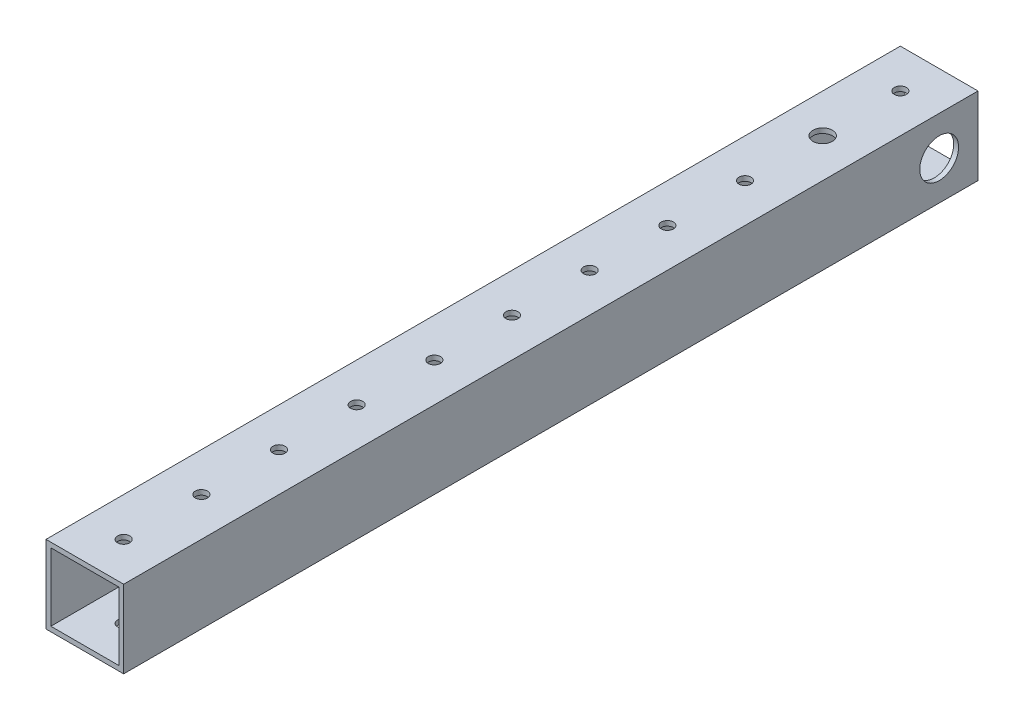
ISO-10303-21;
HEADER;
FILE_DESCRIPTION(('STEP AP214'),'2;1');
FILE_NAME('part.step','',(''),(''),'','','');
FILE_SCHEMA(('AUTOMOTIVE_DESIGN { 1 0 10303 214 1 1 1 1 }'));
ENDSEC;
DATA;
#1=APPLICATION_CONTEXT('core data for automotive mechanical design processes');
#2=APPLICATION_PROTOCOL_DEFINITION('international standard','automotive_design',2000,#1);
#3=PRODUCT_CONTEXT('',#1,'mechanical');
#4=PRODUCT('Part','Part','',(#3));
#5=PRODUCT_RELATED_PRODUCT_CATEGORY('part','',(#4));
#6=PRODUCT_DEFINITION_FORMATION('','',#4);
#7=PRODUCT_DEFINITION_CONTEXT('part definition',#1,'design');
#8=PRODUCT_DEFINITION('design','',#6,#7);
#9=PRODUCT_DEFINITION_SHAPE('','',#8);
#10=(LENGTH_UNIT() NAMED_UNIT(*) SI_UNIT(.MILLI.,.METRE.));
#11=(NAMED_UNIT(*) PLANE_ANGLE_UNIT() SI_UNIT($,.RADIAN.));
#12=(NAMED_UNIT(*) SI_UNIT($,.STERADIAN.) SOLID_ANGLE_UNIT());
#13=UNCERTAINTY_MEASURE_WITH_UNIT(LENGTH_MEASURE(1.E-05),#10,'distance_accuracy_value','');
#14=(GEOMETRIC_REPRESENTATION_CONTEXT(3) GLOBAL_UNCERTAINTY_ASSIGNED_CONTEXT((#13)) GLOBAL_UNIT_ASSIGNED_CONTEXT((#10,
#11,#12)) REPRESENTATION_CONTEXT('',''));
#15=CARTESIAN_POINT('',(0.,0.,0.));
#16=DIRECTION('',(0.,0.,1.));
#17=DIRECTION('',(1.,0.,0.));
#18=AXIS2_PLACEMENT_3D('',#15,#16,#17);
#19=CARTESIAN_POINT('',(0.,0.,279.4));
#20=DIRECTION('',(0.,0.,1.));
#21=DIRECTION('',(1.,0.,0.));
#22=AXIS2_PLACEMENT_3D('',#19,#20,#21);
#23=PLANE('',#22);
#24=DIRECTION('',(0.,1.,0.));
#25=VECTOR('',#24,1.);
#26=CARTESIAN_POINT('',(12.7,12.7,279.4));
#27=LINE('',#26,#25);
#28=CARTESIAN_POINT('',(12.7,-12.7,279.4));
#29=VERTEX_POINT('',#28);
#30=CARTESIAN_POINT('',(12.7,12.7,279.4));
#31=VERTEX_POINT('',#30);
#32=EDGE_CURVE('E138',#29,#31,#27,.T.);
#33=ORIENTED_EDGE('',*,*,#32,.T.);
#34=DIRECTION('',(-1.,0.,0.));
#35=VECTOR('',#34,1.);
#36=CARTESIAN_POINT('',(-12.7,12.7,279.4));
#37=LINE('',#36,#35);
#38=CARTESIAN_POINT('',(-12.7,12.7,279.4));
#39=VERTEX_POINT('',#38);
#40=EDGE_CURVE('E141',#31,#39,#37,.T.);
#41=ORIENTED_EDGE('',*,*,#40,.T.);
#42=DIRECTION('',(0.,-1.,0.));
#43=VECTOR('',#42,1.);
#44=CARTESIAN_POINT('',(-12.7,12.7,279.4));
#45=LINE('',#44,#43);
#46=CARTESIAN_POINT('',(-12.7,-12.7,279.4));
#47=VERTEX_POINT('',#46);
#48=EDGE_CURVE('E144',#39,#47,#45,.T.);
#49=ORIENTED_EDGE('',*,*,#48,.T.);
#50=DIRECTION('',(1.,0.,0.));
#51=VECTOR('',#50,1.);
#52=CARTESIAN_POINT('',(-12.7,-12.7,279.4));
#53=LINE('',#52,#51);
#54=EDGE_CURVE('E146',#47,#29,#53,.T.);
#55=ORIENTED_EDGE('',*,*,#54,.T.);
#56=EDGE_LOOP('',(#33,#41,#49,#55));
#57=FACE_BOUND('',#56,.T.);
#58=DIRECTION('',(-1.,0.,0.));
#59=VECTOR('',#58,1.);
#60=CARTESIAN_POINT('',(-11.1125,11.1125,279.4));
#61=LINE('',#60,#59);
#62=CARTESIAN_POINT('',(11.1125,11.1125,279.4));
#63=VERTEX_POINT('',#62);
#64=CARTESIAN_POINT('',(-11.1125,11.1125,279.4));
#65=VERTEX_POINT('',#64);
#66=EDGE_CURVE('E108',#63,#65,#61,.T.);
#67=ORIENTED_EDGE('',*,*,#66,.F.);
#68=DIRECTION('',(0.,1.,0.));
#69=VECTOR('',#68,1.);
#70=CARTESIAN_POINT('',(11.1125,11.1125,279.4));
#71=LINE('',#70,#69);
#72=CARTESIAN_POINT('',(11.1125,-11.1125,279.4));
#73=VERTEX_POINT('',#72);
#74=EDGE_CURVE('E100',#73,#63,#71,.T.);
#75=ORIENTED_EDGE('',*,*,#74,.F.);
#76=DIRECTION('',(1.,0.,0.));
#77=VECTOR('',#76,1.);
#78=CARTESIAN_POINT('',(-11.1125,-11.1125,279.4));
#79=LINE('',#78,#77);
#80=CARTESIAN_POINT('',(-11.1125,-11.1125,279.4));
#81=VERTEX_POINT('',#80);
#82=EDGE_CURVE('E122',#81,#73,#79,.T.);
#83=ORIENTED_EDGE('',*,*,#82,.F.);
#84=DIRECTION('',(0.,-1.,0.));
#85=VECTOR('',#84,1.);
#86=CARTESIAN_POINT('',(-11.1125,11.1125,279.4));
#87=LINE('',#86,#85);
#88=EDGE_CURVE('E120',#65,#81,#87,.T.);
#89=ORIENTED_EDGE('',*,*,#88,.F.);
#90=EDGE_LOOP('',(#67,#75,#83,#89));
#91=FACE_BOUND('',#90,.T.);
#92=ADVANCED_FACE('F33',(#57,#91),#23,.T.);
#93=CARTESIAN_POINT('',(0.,0.,0.));
#94=DIRECTION('',(0.,0.,1.));
#95=DIRECTION('',(1.,0.,0.));
#96=AXIS2_PLACEMENT_3D('',#93,#94,#95);
#97=PLANE('',#96);
#98=DIRECTION('',(0.,1.,0.));
#99=VECTOR('',#98,1.);
#100=CARTESIAN_POINT('',(12.7,12.7,0.));
#101=LINE('',#100,#99);
#102=CARTESIAN_POINT('',(12.7,-12.7,0.));
#103=VERTEX_POINT('',#102);
#104=CARTESIAN_POINT('',(12.7,12.7,0.));
#105=VERTEX_POINT('',#104);
#106=EDGE_CURVE('E116',#103,#105,#101,.T.);
#107=ORIENTED_EDGE('',*,*,#106,.F.);
#108=DIRECTION('',(1.,0.,0.));
#109=VECTOR('',#108,1.);
#110=CARTESIAN_POINT('',(-12.7,-12.7,0.));
#111=LINE('',#110,#109);
#112=CARTESIAN_POINT('',(-12.7,-12.7,0.));
#113=VERTEX_POINT('',#112);
#114=EDGE_CURVE('E142',#113,#103,#111,.T.);
#115=ORIENTED_EDGE('',*,*,#114,.F.);
#116=DIRECTION('',(0.,-1.,0.));
#117=VECTOR('',#116,1.);
#118=CARTESIAN_POINT('',(-12.7,12.7,0.));
#119=LINE('',#118,#117);
#120=CARTESIAN_POINT('',(-12.7,12.7,0.));
#121=VERTEX_POINT('',#120);
#122=EDGE_CURVE('E153',#121,#113,#119,.T.);
#123=ORIENTED_EDGE('',*,*,#122,.F.);
#124=DIRECTION('',(-1.,0.,0.));
#125=VECTOR('',#124,1.);
#126=CARTESIAN_POINT('',(-12.7,12.7,0.));
#127=LINE('',#126,#125);
#128=EDGE_CURVE('E151',#105,#121,#127,.T.);
#129=ORIENTED_EDGE('',*,*,#128,.F.);
#130=EDGE_LOOP('',(#107,#115,#123,#129));
#131=FACE_BOUND('',#130,.T.);
#132=DIRECTION('',(0.,1.,0.));
#133=VECTOR('',#132,1.);
#134=CARTESIAN_POINT('',(11.1125,11.1125,0.));
#135=LINE('',#134,#133);
#136=CARTESIAN_POINT('',(11.1125,-11.1125,0.));
#137=VERTEX_POINT('',#136);
#138=CARTESIAN_POINT('',(11.1125,11.1125,0.));
#139=VERTEX_POINT('',#138);
#140=EDGE_CURVE('E58',#137,#139,#135,.T.);
#141=ORIENTED_EDGE('',*,*,#140,.T.);
#142=DIRECTION('',(-1.,0.,0.));
#143=VECTOR('',#142,1.);
#144=CARTESIAN_POINT('',(-11.1125,11.1125,0.));
#145=LINE('',#144,#143);
#146=CARTESIAN_POINT('',(-11.1125,11.1125,0.));
#147=VERTEX_POINT('',#146);
#148=EDGE_CURVE('E115',#139,#147,#145,.T.);
#149=ORIENTED_EDGE('',*,*,#148,.T.);
#150=DIRECTION('',(0.,-1.,0.));
#151=VECTOR('',#150,1.);
#152=CARTESIAN_POINT('',(-11.1125,11.1125,0.));
#153=LINE('',#152,#151);
#154=CARTESIAN_POINT('',(-11.1125,-11.1125,0.));
#155=VERTEX_POINT('',#154);
#156=EDGE_CURVE('E130',#147,#155,#153,.T.);
#157=ORIENTED_EDGE('',*,*,#156,.T.);
#158=DIRECTION('',(1.,0.,0.));
#159=VECTOR('',#158,1.);
#160=CARTESIAN_POINT('',(-11.1125,-11.1125,0.));
#161=LINE('',#160,#159);
#162=EDGE_CURVE('E109',#155,#137,#161,.T.);
#163=ORIENTED_EDGE('',*,*,#162,.T.);
#164=EDGE_LOOP('',(#141,#149,#157,#163));
#165=FACE_BOUND('',#164,.T.);
#166=ADVANCED_FACE('F320',(#131,#165),#97,.F.);
#167=CARTESIAN_POINT('',(12.7,12.7,279.4));
#168=DIRECTION('',(-1.,0.,0.));
#169=DIRECTION('',(0.,-1.,0.));
#170=AXIS2_PLACEMENT_3D('',#167,#168,#169);
#171=PLANE('',#170);
#172=CARTESIAN_POINT('',(12.7,0.,12.7));
#173=DIRECTION('',(1.,0.,0.));
#174=DIRECTION('',(0.,1.,0.));
#175=AXIS2_PLACEMENT_3D('',#172,#173,#174);
#176=CIRCLE('',#175,6.35);
#177=CARTESIAN_POINT('',(12.7,6.35,12.7));
#178=VERTEX_POINT('',#177);
#179=EDGE_CURVE('E454',#178,#178,#176,.T.);
#180=ORIENTED_EDGE('',*,*,#179,.F.);
#181=EDGE_LOOP('',(#180));
#182=FACE_BOUND('',#181,.T.);
#183=ORIENTED_EDGE('',*,*,#106,.T.);
#184=DIRECTION('',(0.,0.,-1.));
#185=VECTOR('',#184,1.);
#186=CARTESIAN_POINT('',(12.7,12.7,279.4));
#187=LINE('',#186,#185);
#188=EDGE_CURVE('E11',#31,#105,#187,.T.);
#189=ORIENTED_EDGE('',*,*,#188,.F.);
#190=ORIENTED_EDGE('',*,*,#32,.F.);
#191=DIRECTION('',(0.,0.,-1.));
#192=VECTOR('',#191,1.);
#193=CARTESIAN_POINT('',(12.7,-12.7,279.4));
#194=LINE('',#193,#192);
#195=EDGE_CURVE('E148',#29,#103,#194,.T.);
#196=ORIENTED_EDGE('',*,*,#195,.T.);
#197=EDGE_LOOP('',(#183,#189,#190,#196));
#198=FACE_BOUND('',#197,.T.);
#199=ADVANCED_FACE('F35',(#182,#198),#171,.F.);
#200=CARTESIAN_POINT('',(-12.7,12.7,279.4));
#201=DIRECTION('',(0.,-1.,0.));
#202=DIRECTION('',(0.,0.,-1.));
#203=AXIS2_PLACEMENT_3D('',#200,#201,#202);
#204=PLANE('',#203);
#205=CARTESIAN_POINT('',(-7.9815263405954E-13,12.7,38.1000000000002));
#206=DIRECTION('',(0.,1.,0.));
#207=DIRECTION('',(0.,0.,1.));
#208=AXIS2_PLACEMENT_3D('',#205,#206,#207);
#209=CIRCLE('',#208,3.175);
#210=CARTESIAN_POINT('',(-7.9815263405954E-13,12.7,41.2750000000002));
#211=VERTEX_POINT('',#210);
#212=EDGE_CURVE('E221',#211,#211,#209,.T.);
#213=ORIENTED_EDGE('',*,*,#212,.F.);
#214=EDGE_LOOP('',(#213));
#215=FACE_BOUND('',#214,.T.);
#216=CARTESIAN_POINT('',(-8.86836260066155E-13,12.7,12.7000000000002));
#217=DIRECTION('',(0.,1.,0.));
#218=DIRECTION('',(0.,0.,1.));
#219=AXIS2_PLACEMENT_3D('',#216,#217,#218);
#220=CIRCLE('',#219,1.98437499999999);
#221=CARTESIAN_POINT('',(-8.86836260066155E-13,12.7,14.6843750000002));
#222=VERTEX_POINT('',#221);
#223=EDGE_CURVE('E218',#222,#222,#220,.T.);
#224=ORIENTED_EDGE('',*,*,#223,.F.);
#225=EDGE_LOOP('',(#224));
#226=FACE_BOUND('',#225,.T.);
#227=CARTESIAN_POINT('',(-7.09469008052924E-13,12.7,63.5000000000002));
#228=DIRECTION('',(0.,1.,0.));
#229=DIRECTION('',(0.,0.,1.));
#230=AXIS2_PLACEMENT_3D('',#227,#228,#229);
#231=CIRCLE('',#230,1.98437499999999);
#232=CARTESIAN_POINT('',(-7.09469008052924E-13,12.7,65.4843750000002));
#233=VERTEX_POINT('',#232);
#234=EDGE_CURVE('E237',#233,#233,#231,.T.);
#235=ORIENTED_EDGE('',*,*,#234,.F.);
#236=EDGE_LOOP('',(#235));
#237=FACE_BOUND('',#236,.T.);
#238=CARTESIAN_POINT('',(-6.20785382046309E-13,12.7,88.9000000000001));
#239=DIRECTION('',(0.,1.,0.));
#240=DIRECTION('',(0.,0.,1.));
#241=AXIS2_PLACEMENT_3D('',#238,#239,#240);
#242=CIRCLE('',#241,1.98437499999999);
#243=CARTESIAN_POINT('',(-6.20785382046309E-13,12.7,90.8843750000001));
#244=VERTEX_POINT('',#243);
#245=EDGE_CURVE('E244',#244,#244,#242,.T.);
#246=ORIENTED_EDGE('',*,*,#245,.F.);
#247=EDGE_LOOP('',(#246));
#248=FACE_BOUND('',#247,.T.);
#249=CARTESIAN_POINT('',(-5.32101756039693E-13,12.7,114.3));
#250=DIRECTION('',(0.,1.,0.));
#251=DIRECTION('',(0.,0.,1.));
#252=AXIS2_PLACEMENT_3D('',#249,#250,#251);
#253=CIRCLE('',#252,1.98437499999999);
#254=CARTESIAN_POINT('',(-5.32101756039693E-13,12.7,116.284375));
#255=VERTEX_POINT('',#254);
#256=EDGE_CURVE('E251',#255,#255,#253,.T.);
#257=ORIENTED_EDGE('',*,*,#256,.F.);
#258=EDGE_LOOP('',(#257));
#259=FACE_BOUND('',#258,.T.);
#260=CARTESIAN_POINT('',(-4.43418130033078E-13,12.7,139.7));
#261=DIRECTION('',(0.,1.,0.));
#262=DIRECTION('',(0.,0.,1.));
#263=AXIS2_PLACEMENT_3D('',#260,#261,#262);
#264=CIRCLE('',#263,1.984375);
#265=CARTESIAN_POINT('',(-4.43418130033078E-13,12.7,141.684375));
#266=VERTEX_POINT('',#265);
#267=EDGE_CURVE('E258',#266,#266,#264,.T.);
#268=ORIENTED_EDGE('',*,*,#267,.F.);
#269=EDGE_LOOP('',(#268));
#270=FACE_BOUND('',#269,.T.);
#271=CARTESIAN_POINT('',(-3.54734504026462E-13,12.7,165.1));
#272=DIRECTION('',(0.,1.,0.));
#273=DIRECTION('',(0.,0.,1.));
#274=AXIS2_PLACEMENT_3D('',#271,#272,#273);
#275=CIRCLE('',#274,1.984375);
#276=CARTESIAN_POINT('',(-3.54734504026462E-13,12.7,167.084375));
#277=VERTEX_POINT('',#276);
#278=EDGE_CURVE('E265',#277,#277,#275,.T.);
#279=ORIENTED_EDGE('',*,*,#278,.F.);
#280=EDGE_LOOP('',(#279));
#281=FACE_BOUND('',#280,.T.);
#282=CARTESIAN_POINT('',(-2.66050878019846E-13,12.7,190.5));
#283=DIRECTION('',(0.,1.,0.));
#284=DIRECTION('',(0.,0.,1.));
#285=AXIS2_PLACEMENT_3D('',#282,#283,#284);
#286=CIRCLE('',#285,1.984375);
#287=CARTESIAN_POINT('',(-2.66050878019846E-13,12.7,192.484375));
#288=VERTEX_POINT('',#287);
#289=EDGE_CURVE('E272',#288,#288,#286,.T.);
#290=ORIENTED_EDGE('',*,*,#289,.F.);
#291=EDGE_LOOP('',(#290));
#292=FACE_BOUND('',#291,.T.);
#293=CARTESIAN_POINT('',(-1.77367252013231E-13,12.7,215.9));
#294=DIRECTION('',(0.,1.,0.));
#295=DIRECTION('',(0.,0.,1.));
#296=AXIS2_PLACEMENT_3D('',#293,#294,#295);
#297=CIRCLE('',#296,1.984375);
#298=CARTESIAN_POINT('',(-1.77367252013231E-13,12.7,217.884375));
#299=VERTEX_POINT('',#298);
#300=EDGE_CURVE('E279',#299,#299,#297,.T.);
#301=ORIENTED_EDGE('',*,*,#300,.F.);
#302=EDGE_LOOP('',(#301));
#303=FACE_BOUND('',#302,.T.);
#304=CARTESIAN_POINT('',(0.,12.7,241.3));
#305=DIRECTION('',(0.,1.,0.));
#306=DIRECTION('',(0.,0.,1.));
#307=AXIS2_PLACEMENT_3D('',#304,#305,#306);
#308=CIRCLE('',#307,1.984375);
#309=CARTESIAN_POINT('',(0.,12.7,243.284375));
#310=VERTEX_POINT('',#309);
#311=EDGE_CURVE('E286',#310,#310,#308,.T.);
#312=ORIENTED_EDGE('',*,*,#311,.F.);
#313=EDGE_LOOP('',(#312));
#314=FACE_BOUND('',#313,.T.);
#315=CARTESIAN_POINT('',(0.,12.7,266.7));
#316=DIRECTION('',(0.,1.,0.));
#317=DIRECTION('',(0.,0.,1.));
#318=AXIS2_PLACEMENT_3D('',#315,#316,#317);
#319=CIRCLE('',#318,1.98437499999999);
#320=CARTESIAN_POINT('',(0.,12.7,268.684375));
#321=VERTEX_POINT('',#320);
#322=EDGE_CURVE('E293',#321,#321,#319,.T.);
#323=ORIENTED_EDGE('',*,*,#322,.F.);
#324=EDGE_LOOP('',(#323));
#325=FACE_BOUND('',#324,.T.);
#326=ORIENTED_EDGE('',*,*,#128,.T.);
#327=DIRECTION('',(0.,0.,-1.));
#328=VECTOR('',#327,1.);
#329=CARTESIAN_POINT('',(-12.7,12.7,279.4));
#330=LINE('',#329,#328);
#331=EDGE_CURVE('E42',#39,#121,#330,.T.);
#332=ORIENTED_EDGE('',*,*,#331,.F.);
#333=ORIENTED_EDGE('',*,*,#40,.F.);
#334=ORIENTED_EDGE('',*,*,#188,.T.);
#335=EDGE_LOOP('',(#326,#332,#333,#334));
#336=FACE_BOUND('',#335,.T.);
#337=ADVANCED_FACE('F333',(#215,#226,#237,#248,#259,#270,#281,#292,#303,#314,#325,#336),#204,.F.);
#338=CARTESIAN_POINT('',(-12.7,12.7,279.4));
#339=DIRECTION('',(1.,0.,0.));
#340=DIRECTION('',(0.,1.,0.));
#341=AXIS2_PLACEMENT_3D('',#338,#339,#340);
#342=PLANE('',#341);
#343=CARTESIAN_POINT('',(-12.7,0.,12.7));
#344=DIRECTION('',(1.,0.,0.));
#345=DIRECTION('',(0.,1.,0.));
#346=AXIS2_PLACEMENT_3D('',#343,#344,#345);
#347=CIRCLE('',#346,6.35);
#348=CARTESIAN_POINT('',(-12.7,6.35,12.7));
#349=VERTEX_POINT('',#348);
#350=EDGE_CURVE('E453',#349,#349,#347,.T.);
#351=ORIENTED_EDGE('',*,*,#350,.T.);
#352=EDGE_LOOP('',(#351));
#353=FACE_BOUND('',#352,.T.);
#354=ORIENTED_EDGE('',*,*,#122,.T.);
#355=DIRECTION('',(0.,0.,-1.));
#356=VECTOR('',#355,1.);
#357=CARTESIAN_POINT('',(-12.7,-12.7,279.4));
#358=LINE('',#357,#356);
#359=EDGE_CURVE('E158',#47,#113,#358,.T.);
#360=ORIENTED_EDGE('',*,*,#359,.F.);
#361=ORIENTED_EDGE('',*,*,#48,.F.);
#362=ORIENTED_EDGE('',*,*,#331,.T.);
#363=EDGE_LOOP('',(#354,#360,#361,#362));
#364=FACE_BOUND('',#363,.T.);
#365=ADVANCED_FACE('F331',(#353,#364),#342,.F.);
#366=CARTESIAN_POINT('',(-12.7,-12.7,279.4));
#367=DIRECTION('',(0.,1.,0.));
#368=DIRECTION('',(0.,0.,1.));
#369=AXIS2_PLACEMENT_3D('',#366,#367,#368);
#370=PLANE('',#369);
#371=CARTESIAN_POINT('',(-7.9815263405954E-13,-12.7,38.1000000000002));
#372=DIRECTION('',(0.,1.,0.));
#373=DIRECTION('',(0.,0.,1.));
#374=AXIS2_PLACEMENT_3D('',#371,#372,#373);
#375=CIRCLE('',#374,3.175);
#376=CARTESIAN_POINT('',(-7.9815263405954E-13,-12.7,41.2750000000002));
#377=VERTEX_POINT('',#376);
#378=EDGE_CURVE('E214',#377,#377,#375,.T.);
#379=ORIENTED_EDGE('',*,*,#378,.T.);
#380=EDGE_LOOP('',(#379));
#381=FACE_BOUND('',#380,.T.);
#382=CARTESIAN_POINT('',(-8.86836260066155E-13,-12.7,12.7000000000002));
#383=DIRECTION('',(0.,1.,0.));
#384=DIRECTION('',(0.,0.,1.));
#385=AXIS2_PLACEMENT_3D('',#382,#383,#384);
#386=CIRCLE('',#385,1.98437499999999);
#387=CARTESIAN_POINT('',(-8.86836260066155E-13,-12.7,14.6843750000002));
#388=VERTEX_POINT('',#387);
#389=EDGE_CURVE('E210',#388,#388,#386,.T.);
#390=ORIENTED_EDGE('',*,*,#389,.T.);
#391=EDGE_LOOP('',(#390));
#392=FACE_BOUND('',#391,.T.);
#393=CARTESIAN_POINT('',(-7.09469008052924E-13,-12.7,63.5000000000002));
#394=DIRECTION('',(0.,1.,0.));
#395=DIRECTION('',(0.,0.,1.));
#396=AXIS2_PLACEMENT_3D('',#393,#394,#395);
#397=CIRCLE('',#396,1.98437499999999);
#398=CARTESIAN_POINT('',(-7.09469008052924E-13,-12.7,65.4843750000002));
#399=VERTEX_POINT('',#398);
#400=EDGE_CURVE('E206',#399,#399,#397,.T.);
#401=ORIENTED_EDGE('',*,*,#400,.T.);
#402=EDGE_LOOP('',(#401));
#403=FACE_BOUND('',#402,.T.);
#404=CARTESIAN_POINT('',(-6.20785382046309E-13,-12.7,88.9000000000001));
#405=DIRECTION('',(0.,1.,0.));
#406=DIRECTION('',(0.,0.,1.));
#407=AXIS2_PLACEMENT_3D('',#404,#405,#406);
#408=CIRCLE('',#407,1.98437499999999);
#409=CARTESIAN_POINT('',(-6.20785382046309E-13,-12.7,90.8843750000001));
#410=VERTEX_POINT('',#409);
#411=EDGE_CURVE('E201',#410,#410,#408,.T.);
#412=ORIENTED_EDGE('',*,*,#411,.T.);
#413=EDGE_LOOP('',(#412));
#414=FACE_BOUND('',#413,.T.);
#415=CARTESIAN_POINT('',(-5.32101756039693E-13,-12.7,114.3));
#416=DIRECTION('',(0.,1.,0.));
#417=DIRECTION('',(0.,0.,1.));
#418=AXIS2_PLACEMENT_3D('',#415,#416,#417);
#419=CIRCLE('',#418,1.98437499999999);
#420=CARTESIAN_POINT('',(-5.32101756039693E-13,-12.7,116.284375));
#421=VERTEX_POINT('',#420);
#422=EDGE_CURVE('E196',#421,#421,#419,.T.);
#423=ORIENTED_EDGE('',*,*,#422,.T.);
#424=EDGE_LOOP('',(#423));
#425=FACE_BOUND('',#424,.T.);
#426=CARTESIAN_POINT('',(-4.43418130033078E-13,-12.7,139.7));
#427=DIRECTION('',(0.,1.,0.));
#428=DIRECTION('',(0.,0.,1.));
#429=AXIS2_PLACEMENT_3D('',#426,#427,#428);
#430=CIRCLE('',#429,1.984375);
#431=CARTESIAN_POINT('',(-4.43418130033078E-13,-12.7,141.684375));
#432=VERTEX_POINT('',#431);
#433=EDGE_CURVE('E191',#432,#432,#430,.T.);
#434=ORIENTED_EDGE('',*,*,#433,.T.);
#435=EDGE_LOOP('',(#434));
#436=FACE_BOUND('',#435,.T.);
#437=CARTESIAN_POINT('',(-3.54734504026462E-13,-12.7,165.1));
#438=DIRECTION('',(0.,1.,0.));
#439=DIRECTION('',(0.,0.,1.));
#440=AXIS2_PLACEMENT_3D('',#437,#438,#439);
#441=CIRCLE('',#440,1.984375);
#442=CARTESIAN_POINT('',(-3.54734504026462E-13,-12.7,167.084375));
#443=VERTEX_POINT('',#442);
#444=EDGE_CURVE('E186',#443,#443,#441,.T.);
#445=ORIENTED_EDGE('',*,*,#444,.T.);
#446=EDGE_LOOP('',(#445));
#447=FACE_BOUND('',#446,.T.);
#448=CARTESIAN_POINT('',(-2.66050878019846E-13,-12.7,190.5));
#449=DIRECTION('',(0.,1.,0.));
#450=DIRECTION('',(0.,0.,1.));
#451=AXIS2_PLACEMENT_3D('',#448,#449,#450);
#452=CIRCLE('',#451,1.984375);
#453=CARTESIAN_POINT('',(-2.66050878019846E-13,-12.7,192.484375));
#454=VERTEX_POINT('',#453);
#455=EDGE_CURVE('E181',#454,#454,#452,.T.);
#456=ORIENTED_EDGE('',*,*,#455,.T.);
#457=EDGE_LOOP('',(#456));
#458=FACE_BOUND('',#457,.T.);
#459=CARTESIAN_POINT('',(-1.77367252013231E-13,-12.7,215.9));
#460=DIRECTION('',(0.,1.,0.));
#461=DIRECTION('',(0.,0.,1.));
#462=AXIS2_PLACEMENT_3D('',#459,#460,#461);
#463=CIRCLE('',#462,1.984375);
#464=CARTESIAN_POINT('',(-1.77367252013231E-13,-12.7,217.884375));
#465=VERTEX_POINT('',#464);
#466=EDGE_CURVE('E176',#465,#465,#463,.T.);
#467=ORIENTED_EDGE('',*,*,#466,.T.);
#468=EDGE_LOOP('',(#467));
#469=FACE_BOUND('',#468,.T.);
#470=CARTESIAN_POINT('',(0.,-12.7,241.3));
#471=DIRECTION('',(0.,1.,0.));
#472=DIRECTION('',(0.,0.,1.));
#473=AXIS2_PLACEMENT_3D('',#470,#471,#472);
#474=CIRCLE('',#473,1.984375);
#475=CARTESIAN_POINT('',(0.,-12.7,243.284375));
#476=VERTEX_POINT('',#475);
#477=EDGE_CURVE('E171',#476,#476,#474,.T.);
#478=ORIENTED_EDGE('',*,*,#477,.T.);
#479=EDGE_LOOP('',(#478));
#480=FACE_BOUND('',#479,.T.);
#481=CARTESIAN_POINT('',(0.,-12.7,266.7));
#482=DIRECTION('',(0.,1.,0.));
#483=DIRECTION('',(0.,0.,1.));
#484=AXIS2_PLACEMENT_3D('',#481,#482,#483);
#485=CIRCLE('',#484,1.98437499999999);
#486=CARTESIAN_POINT('',(0.,-12.7,268.684375));
#487=VERTEX_POINT('',#486);
#488=EDGE_CURVE('E166',#487,#487,#485,.T.);
#489=ORIENTED_EDGE('',*,*,#488,.T.);
#490=EDGE_LOOP('',(#489));
#491=FACE_BOUND('',#490,.T.);
#492=ORIENTED_EDGE('',*,*,#114,.T.);
#493=ORIENTED_EDGE('',*,*,#195,.F.);
#494=ORIENTED_EDGE('',*,*,#54,.F.);
#495=ORIENTED_EDGE('',*,*,#359,.T.);
#496=EDGE_LOOP('',(#492,#493,#494,#495));
#497=FACE_BOUND('',#496,.T.);
#498=ADVANCED_FACE('F314',(#381,#392,#403,#414,#425,#436,#447,#458,#469,#480,#491,#497),#370,.F.);
#499=CARTESIAN_POINT('',(11.1125,11.1125,279.4));
#500=DIRECTION('',(-1.,0.,0.));
#501=DIRECTION('',(0.,0.,1.));
#502=AXIS2_PLACEMENT_3D('',#499,#500,#501);
#503=PLANE('',#502);
#504=CARTESIAN_POINT('',(11.1125,0.,12.7));
#505=DIRECTION('',(-1.,0.,0.));
#506=DIRECTION('',(0.,0.,1.));
#507=AXIS2_PLACEMENT_3D('',#504,#505,#506);
#508=CIRCLE('',#507,6.35);
#509=CARTESIAN_POINT('',(11.1125,0.,19.05));
#510=VERTEX_POINT('',#509);
#511=EDGE_CURVE('E226',#510,#510,#508,.T.);
#512=ORIENTED_EDGE('',*,*,#511,.F.);
#513=EDGE_LOOP('',(#512));
#514=FACE_BOUND('',#513,.T.);
#515=ORIENTED_EDGE('',*,*,#140,.F.);
#516=DIRECTION('',(0.,0.,-1.));
#517=VECTOR('',#516,1.);
#518=CARTESIAN_POINT('',(11.1125,-11.1125,279.4));
#519=LINE('',#518,#517);
#520=EDGE_CURVE('E104',#73,#137,#519,.T.);
#521=ORIENTED_EDGE('',*,*,#520,.F.);
#522=ORIENTED_EDGE('',*,*,#74,.T.);
#523=DIRECTION('',(0.,0.,-1.));
#524=VECTOR('',#523,1.);
#525=CARTESIAN_POINT('',(11.1125,11.1125,279.4));
#526=LINE('',#525,#524);
#527=EDGE_CURVE('E103',#63,#139,#526,.T.);
#528=ORIENTED_EDGE('',*,*,#527,.T.);
#529=EDGE_LOOP('',(#515,#521,#522,#528));
#530=FACE_BOUND('',#529,.T.);
#531=ADVANCED_FACE('F102',(#514,#530),#503,.T.);
#532=CARTESIAN_POINT('',(-11.1125,11.1125,279.4));
#533=DIRECTION('',(0.,-1.,0.));
#534=DIRECTION('',(0.,0.,-1.));
#535=AXIS2_PLACEMENT_3D('',#532,#533,#534);
#536=PLANE('',#535);
#537=CARTESIAN_POINT('',(-7.9815263405954E-13,11.1125,38.1000000000002));
#538=DIRECTION('',(0.,-1.,0.));
#539=DIRECTION('',(0.,0.,-1.));
#540=AXIS2_PLACEMENT_3D('',#537,#538,#539);
#541=CIRCLE('',#540,3.175);
#542=CARTESIAN_POINT('',(-7.9815263405954E-13,11.1125,34.9250000000002));
#543=VERTEX_POINT('',#542);
#544=EDGE_CURVE('E213',#543,#543,#541,.T.);
#545=ORIENTED_EDGE('',*,*,#544,.F.);
#546=EDGE_LOOP('',(#545));
#547=FACE_BOUND('',#546,.T.);
#548=CARTESIAN_POINT('',(-8.86836260066155E-13,11.1125,12.7000000000002));
#549=DIRECTION('',(0.,-1.,0.));
#550=DIRECTION('',(0.,0.,-1.));
#551=AXIS2_PLACEMENT_3D('',#548,#549,#550);
#552=CIRCLE('',#551,1.98437499999999);
#553=CARTESIAN_POINT('',(-8.86836260066155E-13,11.1125,10.7156250000002));
#554=VERTEX_POINT('',#553);
#555=EDGE_CURVE('E209',#554,#554,#552,.T.);
#556=ORIENTED_EDGE('',*,*,#555,.F.);
#557=EDGE_LOOP('',(#556));
#558=FACE_BOUND('',#557,.T.);
#559=CARTESIAN_POINT('',(-7.09469008052924E-13,11.1125,63.5000000000002));
#560=DIRECTION('',(0.,-1.,0.));
#561=DIRECTION('',(0.,0.,-1.));
#562=AXIS2_PLACEMENT_3D('',#559,#560,#561);
#563=CIRCLE('',#562,1.98437499999999);
#564=CARTESIAN_POINT('',(-7.09469008052924E-13,11.1125,61.5156250000002));
#565=VERTEX_POINT('',#564);
#566=EDGE_CURVE('E205',#565,#565,#563,.T.);
#567=ORIENTED_EDGE('',*,*,#566,.F.);
#568=EDGE_LOOP('',(#567));
#569=FACE_BOUND('',#568,.T.);
#570=CARTESIAN_POINT('',(-6.20785382046309E-13,11.1125,88.9000000000001));
#571=DIRECTION('',(0.,-1.,0.));
#572=DIRECTION('',(0.,0.,-1.));
#573=AXIS2_PLACEMENT_3D('',#570,#571,#572);
#574=CIRCLE('',#573,1.98437499999999);
#575=CARTESIAN_POINT('',(-6.20785382046309E-13,11.1125,86.9156250000001));
#576=VERTEX_POINT('',#575);
#577=EDGE_CURVE('E200',#576,#576,#574,.T.);
#578=ORIENTED_EDGE('',*,*,#577,.F.);
#579=EDGE_LOOP('',(#578));
#580=FACE_BOUND('',#579,.T.);
#581=CARTESIAN_POINT('',(-5.32101756039693E-13,11.1125,114.3));
#582=DIRECTION('',(0.,-1.,0.));
#583=DIRECTION('',(0.,0.,-1.));
#584=AXIS2_PLACEMENT_3D('',#581,#582,#583);
#585=CIRCLE('',#584,1.98437499999999);
#586=CARTESIAN_POINT('',(-5.32101756039693E-13,11.1125,112.315625));
#587=VERTEX_POINT('',#586);
#588=EDGE_CURVE('E195',#587,#587,#585,.T.);
#589=ORIENTED_EDGE('',*,*,#588,.F.);
#590=EDGE_LOOP('',(#589));
#591=FACE_BOUND('',#590,.T.);
#592=CARTESIAN_POINT('',(-4.43418130033078E-13,11.1125,139.7));
#593=DIRECTION('',(0.,-1.,0.));
#594=DIRECTION('',(0.,0.,-1.));
#595=AXIS2_PLACEMENT_3D('',#592,#593,#594);
#596=CIRCLE('',#595,1.984375);
#597=CARTESIAN_POINT('',(-4.43418130033078E-13,11.1125,137.715625));
#598=VERTEX_POINT('',#597);
#599=EDGE_CURVE('E190',#598,#598,#596,.T.);
#600=ORIENTED_EDGE('',*,*,#599,.F.);
#601=EDGE_LOOP('',(#600));
#602=FACE_BOUND('',#601,.T.);
#603=CARTESIAN_POINT('',(-3.54734504026462E-13,11.1125,165.1));
#604=DIRECTION('',(0.,-1.,0.));
#605=DIRECTION('',(0.,0.,-1.));
#606=AXIS2_PLACEMENT_3D('',#603,#604,#605);
#607=CIRCLE('',#606,1.984375);
#608=CARTESIAN_POINT('',(-3.54734504026462E-13,11.1125,163.115625));
#609=VERTEX_POINT('',#608);
#610=EDGE_CURVE('E185',#609,#609,#607,.T.);
#611=ORIENTED_EDGE('',*,*,#610,.F.);
#612=EDGE_LOOP('',(#611));
#613=FACE_BOUND('',#612,.T.);
#614=CARTESIAN_POINT('',(-2.66050878019846E-13,11.1125,190.5));
#615=DIRECTION('',(0.,-1.,0.));
#616=DIRECTION('',(0.,0.,-1.));
#617=AXIS2_PLACEMENT_3D('',#614,#615,#616);
#618=CIRCLE('',#617,1.984375);
#619=CARTESIAN_POINT('',(-2.66050878019846E-13,11.1125,188.515625));
#620=VERTEX_POINT('',#619);
#621=EDGE_CURVE('E180',#620,#620,#618,.T.);
#622=ORIENTED_EDGE('',*,*,#621,.F.);
#623=EDGE_LOOP('',(#622));
#624=FACE_BOUND('',#623,.T.);
#625=CARTESIAN_POINT('',(-1.77367252013231E-13,11.1125,215.9));
#626=DIRECTION('',(0.,-1.,0.));
#627=DIRECTION('',(0.,0.,-1.));
#628=AXIS2_PLACEMENT_3D('',#625,#626,#627);
#629=CIRCLE('',#628,1.984375);
#630=CARTESIAN_POINT('',(-1.77367252013231E-13,11.1125,213.915625));
#631=VERTEX_POINT('',#630);
#632=EDGE_CURVE('E175',#631,#631,#629,.T.);
#633=ORIENTED_EDGE('',*,*,#632,.F.);
#634=EDGE_LOOP('',(#633));
#635=FACE_BOUND('',#634,.T.);
#636=CARTESIAN_POINT('',(0.,11.1125,241.3));
#637=DIRECTION('',(0.,-1.,0.));
#638=DIRECTION('',(0.,0.,-1.));
#639=AXIS2_PLACEMENT_3D('',#636,#637,#638);
#640=CIRCLE('',#639,1.984375);
#641=CARTESIAN_POINT('',(0.,11.1125,239.315625));
#642=VERTEX_POINT('',#641);
#643=EDGE_CURVE('E170',#642,#642,#640,.T.);
#644=ORIENTED_EDGE('',*,*,#643,.F.);
#645=EDGE_LOOP('',(#644));
#646=FACE_BOUND('',#645,.T.);
#647=CARTESIAN_POINT('',(0.,11.1125,266.7));
#648=DIRECTION('',(0.,-1.,0.));
#649=DIRECTION('',(0.,0.,-1.));
#650=AXIS2_PLACEMENT_3D('',#647,#648,#649);
#651=CIRCLE('',#650,1.98437499999999);
#652=CARTESIAN_POINT('',(0.,11.1125,264.715625));
#653=VERTEX_POINT('',#652);
#654=EDGE_CURVE('E128',#653,#653,#651,.T.);
#655=ORIENTED_EDGE('',*,*,#654,.F.);
#656=EDGE_LOOP('',(#655));
#657=FACE_BOUND('',#656,.T.);
#658=ORIENTED_EDGE('',*,*,#148,.F.);
#659=ORIENTED_EDGE('',*,*,#527,.F.);
#660=ORIENTED_EDGE('',*,*,#66,.T.);
#661=DIRECTION('',(0.,0.,-1.));
#662=VECTOR('',#661,1.);
#663=CARTESIAN_POINT('',(-11.1125,11.1125,279.4));
#664=LINE('',#663,#662);
#665=EDGE_CURVE('E117',#65,#147,#664,.T.);
#666=ORIENTED_EDGE('',*,*,#665,.T.);
#667=EDGE_LOOP('',(#658,#659,#660,#666));
#668=FACE_BOUND('',#667,.T.);
#669=ADVANCED_FACE('F112',(#547,#558,#569,#580,#591,#602,#613,#624,#635,#646,#657,#668),#536,.T.);
#670=CARTESIAN_POINT('',(-11.1125,11.1125,279.4));
#671=DIRECTION('',(1.,0.,0.));
#672=DIRECTION('',(0.,1.,0.));
#673=AXIS2_PLACEMENT_3D('',#670,#671,#672);
#674=PLANE('',#673);
#675=CARTESIAN_POINT('',(-11.1125,0.,12.7));
#676=DIRECTION('',(1.,0.,0.));
#677=DIRECTION('',(0.,1.,0.));
#678=AXIS2_PLACEMENT_3D('',#675,#676,#677);
#679=CIRCLE('',#678,6.35);
#680=CARTESIAN_POINT('',(-11.1125,6.35,12.7));
#681=VERTEX_POINT('',#680);
#682=EDGE_CURVE('E37',#681,#681,#679,.T.);
#683=ORIENTED_EDGE('',*,*,#682,.F.);
#684=EDGE_LOOP('',(#683));
#685=FACE_BOUND('',#684,.T.);
#686=ORIENTED_EDGE('',*,*,#156,.F.);
#687=ORIENTED_EDGE('',*,*,#665,.F.);
#688=ORIENTED_EDGE('',*,*,#88,.T.);
#689=DIRECTION('',(0.,0.,-1.));
#690=VECTOR('',#689,1.);
#691=CARTESIAN_POINT('',(-11.1125,-11.1125,279.4));
#692=LINE('',#691,#690);
#693=EDGE_CURVE('E50',#81,#155,#692,.T.);
#694=ORIENTED_EDGE('',*,*,#693,.T.);
#695=EDGE_LOOP('',(#686,#687,#688,#694));
#696=FACE_BOUND('',#695,.T.);
#697=ADVANCED_FACE('F304',(#685,#696),#674,.T.);
#698=CARTESIAN_POINT('',(-11.1125,-11.1125,279.4));
#699=DIRECTION('',(0.,1.,0.));
#700=DIRECTION('',(0.,0.,1.));
#701=AXIS2_PLACEMENT_3D('',#698,#699,#700);
#702=PLANE('',#701);
#703=CARTESIAN_POINT('',(-7.9815263405954E-13,-11.1125,38.1000000000002));
#704=DIRECTION('',(0.,1.,0.));
#705=DIRECTION('',(0.,0.,1.));
#706=AXIS2_PLACEMENT_3D('',#703,#704,#705);
#707=CIRCLE('',#706,3.175);
#708=CARTESIAN_POINT('',(-7.9815263405954E-13,-11.1125,41.2750000000002));
#709=VERTEX_POINT('',#708);
#710=EDGE_CURVE('E211',#709,#709,#707,.T.);
#711=ORIENTED_EDGE('',*,*,#710,.F.);
#712=EDGE_LOOP('',(#711));
#713=FACE_BOUND('',#712,.T.);
#714=CARTESIAN_POINT('',(-8.86836260066155E-13,-11.1125,12.7000000000002));
#715=DIRECTION('',(0.,1.,0.));
#716=DIRECTION('',(0.,0.,1.));
#717=AXIS2_PLACEMENT_3D('',#714,#715,#716);
#718=CIRCLE('',#717,1.98437499999999);
#719=CARTESIAN_POINT('',(-8.86836260066155E-13,-11.1125,14.6843750000002));
#720=VERTEX_POINT('',#719);
#721=EDGE_CURVE('E207',#720,#720,#718,.T.);
#722=ORIENTED_EDGE('',*,*,#721,.F.);
#723=EDGE_LOOP('',(#722));
#724=FACE_BOUND('',#723,.T.);
#725=CARTESIAN_POINT('',(-7.09469008052924E-13,-11.1125,63.5000000000002));
#726=DIRECTION('',(0.,1.,0.));
#727=DIRECTION('',(0.,0.,1.));
#728=AXIS2_PLACEMENT_3D('',#725,#726,#727);
#729=CIRCLE('',#728,1.98437499999999);
#730=CARTESIAN_POINT('',(-7.09469008052924E-13,-11.1125,65.4843750000002));
#731=VERTEX_POINT('',#730);
#732=EDGE_CURVE('E202',#731,#731,#729,.T.);
#733=ORIENTED_EDGE('',*,*,#732,.F.);
#734=EDGE_LOOP('',(#733));
#735=FACE_BOUND('',#734,.T.);
#736=CARTESIAN_POINT('',(-6.20785382046309E-13,-11.1125,88.9000000000001));
#737=DIRECTION('',(0.,1.,0.));
#738=DIRECTION('',(0.,0.,1.));
#739=AXIS2_PLACEMENT_3D('',#736,#737,#738);
#740=CIRCLE('',#739,1.98437499999999);
#741=CARTESIAN_POINT('',(-6.20785382046309E-13,-11.1125,90.8843750000001));
#742=VERTEX_POINT('',#741);
#743=EDGE_CURVE('E197',#742,#742,#740,.T.);
#744=ORIENTED_EDGE('',*,*,#743,.F.);
#745=EDGE_LOOP('',(#744));
#746=FACE_BOUND('',#745,.T.);
#747=CARTESIAN_POINT('',(-5.32101756039693E-13,-11.1125,114.3));
#748=DIRECTION('',(0.,1.,0.));
#749=DIRECTION('',(0.,0.,1.));
#750=AXIS2_PLACEMENT_3D('',#747,#748,#749);
#751=CIRCLE('',#750,1.98437499999999);
#752=CARTESIAN_POINT('',(-5.32101756039693E-13,-11.1125,116.284375));
#753=VERTEX_POINT('',#752);
#754=EDGE_CURVE('E192',#753,#753,#751,.T.);
#755=ORIENTED_EDGE('',*,*,#754,.F.);
#756=EDGE_LOOP('',(#755));
#757=FACE_BOUND('',#756,.T.);
#758=CARTESIAN_POINT('',(-4.43418130033078E-13,-11.1125,139.7));
#759=DIRECTION('',(0.,1.,0.));
#760=DIRECTION('',(0.,0.,1.));
#761=AXIS2_PLACEMENT_3D('',#758,#759,#760);
#762=CIRCLE('',#761,1.984375);
#763=CARTESIAN_POINT('',(-4.43418130033078E-13,-11.1125,141.684375));
#764=VERTEX_POINT('',#763);
#765=EDGE_CURVE('E187',#764,#764,#762,.T.);
#766=ORIENTED_EDGE('',*,*,#765,.F.);
#767=EDGE_LOOP('',(#766));
#768=FACE_BOUND('',#767,.T.);
#769=CARTESIAN_POINT('',(-3.54734504026462E-13,-11.1125,165.1));
#770=DIRECTION('',(0.,1.,0.));
#771=DIRECTION('',(0.,0.,1.));
#772=AXIS2_PLACEMENT_3D('',#769,#770,#771);
#773=CIRCLE('',#772,1.984375);
#774=CARTESIAN_POINT('',(-3.54734504026462E-13,-11.1125,167.084375));
#775=VERTEX_POINT('',#774);
#776=EDGE_CURVE('E182',#775,#775,#773,.T.);
#777=ORIENTED_EDGE('',*,*,#776,.F.);
#778=EDGE_LOOP('',(#777));
#779=FACE_BOUND('',#778,.T.);
#780=CARTESIAN_POINT('',(-2.66050878019846E-13,-11.1125,190.5));
#781=DIRECTION('',(0.,1.,0.));
#782=DIRECTION('',(0.,0.,1.));
#783=AXIS2_PLACEMENT_3D('',#780,#781,#782);
#784=CIRCLE('',#783,1.984375);
#785=CARTESIAN_POINT('',(-2.66050878019846E-13,-11.1125,192.484375));
#786=VERTEX_POINT('',#785);
#787=EDGE_CURVE('E177',#786,#786,#784,.T.);
#788=ORIENTED_EDGE('',*,*,#787,.F.);
#789=EDGE_LOOP('',(#788));
#790=FACE_BOUND('',#789,.T.);
#791=CARTESIAN_POINT('',(-1.77367252013231E-13,-11.1125,215.9));
#792=DIRECTION('',(0.,1.,0.));
#793=DIRECTION('',(0.,0.,1.));
#794=AXIS2_PLACEMENT_3D('',#791,#792,#793);
#795=CIRCLE('',#794,1.984375);
#796=CARTESIAN_POINT('',(-1.77367252013231E-13,-11.1125,217.884375));
#797=VERTEX_POINT('',#796);
#798=EDGE_CURVE('E172',#797,#797,#795,.T.);
#799=ORIENTED_EDGE('',*,*,#798,.F.);
#800=EDGE_LOOP('',(#799));
#801=FACE_BOUND('',#800,.T.);
#802=CARTESIAN_POINT('',(0.,-11.1125,241.3));
#803=DIRECTION('',(0.,1.,0.));
#804=DIRECTION('',(0.,0.,1.));
#805=AXIS2_PLACEMENT_3D('',#802,#803,#804);
#806=CIRCLE('',#805,1.984375);
#807=CARTESIAN_POINT('',(0.,-11.1125,243.284375));
#808=VERTEX_POINT('',#807);
#809=EDGE_CURVE('E167',#808,#808,#806,.T.);
#810=ORIENTED_EDGE('',*,*,#809,.F.);
#811=EDGE_LOOP('',(#810));
#812=FACE_BOUND('',#811,.T.);
#813=CARTESIAN_POINT('',(0.,-11.1125,266.7));
#814=DIRECTION('',(0.,1.,0.));
#815=DIRECTION('',(0.,0.,1.));
#816=AXIS2_PLACEMENT_3D('',#813,#814,#815);
#817=CIRCLE('',#816,1.98437499999999);
#818=CARTESIAN_POINT('',(0.,-11.1125,268.684375));
#819=VERTEX_POINT('',#818);
#820=EDGE_CURVE('E163',#819,#819,#817,.T.);
#821=ORIENTED_EDGE('',*,*,#820,.F.);
#822=EDGE_LOOP('',(#821));
#823=FACE_BOUND('',#822,.T.);
#824=ORIENTED_EDGE('',*,*,#162,.F.);
#825=ORIENTED_EDGE('',*,*,#693,.F.);
#826=ORIENTED_EDGE('',*,*,#82,.T.);
#827=ORIENTED_EDGE('',*,*,#520,.T.);
#828=EDGE_LOOP('',(#824,#825,#826,#827));
#829=FACE_BOUND('',#828,.T.);
#830=ADVANCED_FACE('F311',(#713,#724,#735,#746,#757,#768,#779,#790,#801,#812,#823,#829),#702,.T.);
#831=CARTESIAN_POINT('',(0.,-12.7,266.7));
#832=DIRECTION('',(0.,1.,0.));
#833=DIRECTION('',(0.,0.,1.));
#834=AXIS2_PLACEMENT_3D('',#831,#832,#833);
#835=CYLINDRICAL_SURFACE('',#834,1.98437499999999);
#836=ORIENTED_EDGE('',*,*,#820,.T.);
#837=EDGE_LOOP('',(#836));
#838=FACE_BOUND('',#837,.T.);
#839=ORIENTED_EDGE('',*,*,#488,.F.);
#840=EDGE_LOOP('',(#839));
#841=FACE_BOUND('',#840,.T.);
#842=ADVANCED_FACE('F379',(#838,#841),#835,.F.);
#843=ORIENTED_EDGE('',*,*,#654,.T.);
#844=EDGE_LOOP('',(#843));
#845=FACE_BOUND('',#844,.T.);
#846=ORIENTED_EDGE('',*,*,#322,.T.);
#847=EDGE_LOOP('',(#846));
#848=FACE_BOUND('',#847,.T.);
#849=ADVANCED_FACE('F300',(#845,#848),#835,.F.);
#850=CARTESIAN_POINT('',(0.,-12.7,241.3));
#851=DIRECTION('',(0.,1.,0.));
#852=DIRECTION('',(0.,0.,1.));
#853=AXIS2_PLACEMENT_3D('',#850,#851,#852);
#854=CYLINDRICAL_SURFACE('',#853,1.984375);
#855=ORIENTED_EDGE('',*,*,#809,.T.);
#856=EDGE_LOOP('',(#855));
#857=FACE_BOUND('',#856,.T.);
#858=ORIENTED_EDGE('',*,*,#477,.F.);
#859=EDGE_LOOP('',(#858));
#860=FACE_BOUND('',#859,.T.);
#861=ADVANCED_FACE('F389',(#857,#860),#854,.F.);
#862=ORIENTED_EDGE('',*,*,#643,.T.);
#863=EDGE_LOOP('',(#862));
#864=FACE_BOUND('',#863,.T.);
#865=ORIENTED_EDGE('',*,*,#311,.T.);
#866=EDGE_LOOP('',(#865));
#867=FACE_BOUND('',#866,.T.);
#868=ADVANCED_FACE('F392',(#864,#867),#854,.F.);
#869=CARTESIAN_POINT('',(-1.77367252013231E-13,-12.7,215.9));
#870=DIRECTION('',(0.,1.,0.));
#871=DIRECTION('',(0.,0.,1.));
#872=AXIS2_PLACEMENT_3D('',#869,#870,#871);
#873=CYLINDRICAL_SURFACE('',#872,1.984375);
#874=ORIENTED_EDGE('',*,*,#798,.T.);
#875=EDGE_LOOP('',(#874));
#876=FACE_BOUND('',#875,.T.);
#877=ORIENTED_EDGE('',*,*,#466,.F.);
#878=EDGE_LOOP('',(#877));
#879=FACE_BOUND('',#878,.T.);
#880=ADVANCED_FACE('F394',(#876,#879),#873,.F.);
#881=ORIENTED_EDGE('',*,*,#632,.T.);
#882=EDGE_LOOP('',(#881));
#883=FACE_BOUND('',#882,.T.);
#884=ORIENTED_EDGE('',*,*,#300,.T.);
#885=EDGE_LOOP('',(#884));
#886=FACE_BOUND('',#885,.T.);
#887=ADVANCED_FACE('F397',(#883,#886),#873,.F.);
#888=CARTESIAN_POINT('',(-2.66050878019846E-13,-12.7,190.5));
#889=DIRECTION('',(0.,1.,0.));
#890=DIRECTION('',(0.,0.,1.));
#891=AXIS2_PLACEMENT_3D('',#888,#889,#890);
#892=CYLINDRICAL_SURFACE('',#891,1.984375);
#893=ORIENTED_EDGE('',*,*,#787,.T.);
#894=EDGE_LOOP('',(#893));
#895=FACE_BOUND('',#894,.T.);
#896=ORIENTED_EDGE('',*,*,#455,.F.);
#897=EDGE_LOOP('',(#896));
#898=FACE_BOUND('',#897,.T.);
#899=ADVANCED_FACE('F399',(#895,#898),#892,.F.);
#900=ORIENTED_EDGE('',*,*,#621,.T.);
#901=EDGE_LOOP('',(#900));
#902=FACE_BOUND('',#901,.T.);
#903=ORIENTED_EDGE('',*,*,#289,.T.);
#904=EDGE_LOOP('',(#903));
#905=FACE_BOUND('',#904,.T.);
#906=ADVANCED_FACE('F402',(#902,#905),#892,.F.);
#907=CARTESIAN_POINT('',(-3.54734504026462E-13,-12.7,165.1));
#908=DIRECTION('',(0.,1.,0.));
#909=DIRECTION('',(0.,0.,1.));
#910=AXIS2_PLACEMENT_3D('',#907,#908,#909);
#911=CYLINDRICAL_SURFACE('',#910,1.984375);
#912=ORIENTED_EDGE('',*,*,#776,.T.);
#913=EDGE_LOOP('',(#912));
#914=FACE_BOUND('',#913,.T.);
#915=ORIENTED_EDGE('',*,*,#444,.F.);
#916=EDGE_LOOP('',(#915));
#917=FACE_BOUND('',#916,.T.);
#918=ADVANCED_FACE('F404',(#914,#917),#911,.F.);
#919=ORIENTED_EDGE('',*,*,#610,.T.);
#920=EDGE_LOOP('',(#919));
#921=FACE_BOUND('',#920,.T.);
#922=ORIENTED_EDGE('',*,*,#278,.T.);
#923=EDGE_LOOP('',(#922));
#924=FACE_BOUND('',#923,.T.);
#925=ADVANCED_FACE('F407',(#921,#924),#911,.F.);
#926=CARTESIAN_POINT('',(-4.43418130033078E-13,-12.7,139.7));
#927=DIRECTION('',(0.,1.,0.));
#928=DIRECTION('',(0.,0.,1.));
#929=AXIS2_PLACEMENT_3D('',#926,#927,#928);
#930=CYLINDRICAL_SURFACE('',#929,1.984375);
#931=ORIENTED_EDGE('',*,*,#765,.T.);
#932=EDGE_LOOP('',(#931));
#933=FACE_BOUND('',#932,.T.);
#934=ORIENTED_EDGE('',*,*,#433,.F.);
#935=EDGE_LOOP('',(#934));
#936=FACE_BOUND('',#935,.T.);
#937=ADVANCED_FACE('F409',(#933,#936),#930,.F.);
#938=ORIENTED_EDGE('',*,*,#599,.T.);
#939=EDGE_LOOP('',(#938));
#940=FACE_BOUND('',#939,.T.);
#941=ORIENTED_EDGE('',*,*,#267,.T.);
#942=EDGE_LOOP('',(#941));
#943=FACE_BOUND('',#942,.T.);
#944=ADVANCED_FACE('F412',(#940,#943),#930,.F.);
#945=CARTESIAN_POINT('',(-5.32101756039693E-13,-12.7,114.3));
#946=DIRECTION('',(0.,1.,0.));
#947=DIRECTION('',(0.,0.,1.));
#948=AXIS2_PLACEMENT_3D('',#945,#946,#947);
#949=CYLINDRICAL_SURFACE('',#948,1.98437499999999);
#950=ORIENTED_EDGE('',*,*,#754,.T.);
#951=EDGE_LOOP('',(#950));
#952=FACE_BOUND('',#951,.T.);
#953=ORIENTED_EDGE('',*,*,#422,.F.);
#954=EDGE_LOOP('',(#953));
#955=FACE_BOUND('',#954,.T.);
#956=ADVANCED_FACE('F414',(#952,#955),#949,.F.);
#957=ORIENTED_EDGE('',*,*,#588,.T.);
#958=EDGE_LOOP('',(#957));
#959=FACE_BOUND('',#958,.T.);
#960=ORIENTED_EDGE('',*,*,#256,.T.);
#961=EDGE_LOOP('',(#960));
#962=FACE_BOUND('',#961,.T.);
#963=ADVANCED_FACE('F417',(#959,#962),#949,.F.);
#964=CARTESIAN_POINT('',(-6.20785382046309E-13,-12.7,88.9000000000001));
#965=DIRECTION('',(0.,1.,0.));
#966=DIRECTION('',(0.,0.,1.));
#967=AXIS2_PLACEMENT_3D('',#964,#965,#966);
#968=CYLINDRICAL_SURFACE('',#967,1.98437499999999);
#969=ORIENTED_EDGE('',*,*,#743,.T.);
#970=EDGE_LOOP('',(#969));
#971=FACE_BOUND('',#970,.T.);
#972=ORIENTED_EDGE('',*,*,#411,.F.);
#973=EDGE_LOOP('',(#972));
#974=FACE_BOUND('',#973,.T.);
#975=ADVANCED_FACE('F419',(#971,#974),#968,.F.);
#976=ORIENTED_EDGE('',*,*,#577,.T.);
#977=EDGE_LOOP('',(#976));
#978=FACE_BOUND('',#977,.T.);
#979=ORIENTED_EDGE('',*,*,#245,.T.);
#980=EDGE_LOOP('',(#979));
#981=FACE_BOUND('',#980,.T.);
#982=ADVANCED_FACE('F422',(#978,#981),#968,.F.);
#983=CARTESIAN_POINT('',(-7.09469008052924E-13,-12.7,63.5000000000002));
#984=DIRECTION('',(0.,1.,0.));
#985=DIRECTION('',(0.,0.,1.));
#986=AXIS2_PLACEMENT_3D('',#983,#984,#985);
#987=CYLINDRICAL_SURFACE('',#986,1.98437499999999);
#988=ORIENTED_EDGE('',*,*,#732,.T.);
#989=EDGE_LOOP('',(#988));
#990=FACE_BOUND('',#989,.T.);
#991=ORIENTED_EDGE('',*,*,#400,.F.);
#992=EDGE_LOOP('',(#991));
#993=FACE_BOUND('',#992,.T.);
#994=ADVANCED_FACE('F424',(#990,#993),#987,.F.);
#995=ORIENTED_EDGE('',*,*,#566,.T.);
#996=EDGE_LOOP('',(#995));
#997=FACE_BOUND('',#996,.T.);
#998=ORIENTED_EDGE('',*,*,#234,.T.);
#999=EDGE_LOOP('',(#998));
#1000=FACE_BOUND('',#999,.T.);
#1001=ADVANCED_FACE('F427',(#997,#1000),#987,.F.);
#1002=CARTESIAN_POINT('',(-8.86836260066155E-13,-12.7,12.7000000000002));
#1003=DIRECTION('',(0.,1.,0.));
#1004=DIRECTION('',(0.,0.,1.));
#1005=AXIS2_PLACEMENT_3D('',#1002,#1003,#1004);
#1006=CYLINDRICAL_SURFACE('',#1005,1.98437499999999);
#1007=ORIENTED_EDGE('',*,*,#721,.T.);
#1008=EDGE_LOOP('',(#1007));
#1009=FACE_BOUND('',#1008,.T.);
#1010=ORIENTED_EDGE('',*,*,#389,.F.);
#1011=EDGE_LOOP('',(#1010));
#1012=FACE_BOUND('',#1011,.T.);
#1013=ADVANCED_FACE('F429',(#1009,#1012),#1006,.F.);
#1014=ORIENTED_EDGE('',*,*,#555,.T.);
#1015=EDGE_LOOP('',(#1014));
#1016=FACE_BOUND('',#1015,.T.);
#1017=ORIENTED_EDGE('',*,*,#223,.T.);
#1018=EDGE_LOOP('',(#1017));
#1019=FACE_BOUND('',#1018,.T.);
#1020=ADVANCED_FACE('F432',(#1016,#1019),#1006,.F.);
#1021=CARTESIAN_POINT('',(-7.9815263405954E-13,-12.7,38.1000000000002));
#1022=DIRECTION('',(0.,1.,0.));
#1023=DIRECTION('',(0.,0.,1.));
#1024=AXIS2_PLACEMENT_3D('',#1021,#1022,#1023);
#1025=CYLINDRICAL_SURFACE('',#1024,3.175);
#1026=ORIENTED_EDGE('',*,*,#710,.T.);
#1027=EDGE_LOOP('',(#1026));
#1028=FACE_BOUND('',#1027,.T.);
#1029=ORIENTED_EDGE('',*,*,#378,.F.);
#1030=EDGE_LOOP('',(#1029));
#1031=FACE_BOUND('',#1030,.T.);
#1032=ADVANCED_FACE('F434',(#1028,#1031),#1025,.F.);
#1033=ORIENTED_EDGE('',*,*,#544,.T.);
#1034=EDGE_LOOP('',(#1033));
#1035=FACE_BOUND('',#1034,.T.);
#1036=ORIENTED_EDGE('',*,*,#212,.T.);
#1037=EDGE_LOOP('',(#1036));
#1038=FACE_BOUND('',#1037,.T.);
#1039=ADVANCED_FACE('F437',(#1035,#1038),#1025,.F.);
#1040=CARTESIAN_POINT('',(-12.7,0.,12.7));
#1041=DIRECTION('',(1.,0.,0.));
#1042=DIRECTION('',(0.,1.,0.));
#1043=AXIS2_PLACEMENT_3D('',#1040,#1041,#1042);
#1044=CYLINDRICAL_SURFACE('',#1043,6.35);
#1045=ORIENTED_EDGE('',*,*,#682,.T.);
#1046=EDGE_LOOP('',(#1045));
#1047=FACE_BOUND('',#1046,.T.);
#1048=ORIENTED_EDGE('',*,*,#350,.F.);
#1049=EDGE_LOOP('',(#1048));
#1050=FACE_BOUND('',#1049,.T.);
#1051=ADVANCED_FACE('F438',(#1047,#1050),#1044,.F.);
#1052=ORIENTED_EDGE('',*,*,#511,.T.);
#1053=EDGE_LOOP('',(#1052));
#1054=FACE_BOUND('',#1053,.T.);
#1055=ORIENTED_EDGE('',*,*,#179,.T.);
#1056=EDGE_LOOP('',(#1055));
#1057=FACE_BOUND('',#1056,.T.);
#1058=ADVANCED_FACE('F440',(#1054,#1057),#1044,.F.);
#1059=CLOSED_SHELL('',(#92,#166,#199,#337,#365,#498,#531,#669,#697,#830,#842,#849,#861,#868,
#880,#887,#899,#906,#918,#925,#937,#944,#956,#963,#975,#982,#994,#1001,#1013,#1020,#1032,#1039,
#1051,#1058));
#1060=MANIFOLD_SOLID_BREP('B2',#1059);
#1061=ADVANCED_BREP_SHAPE_REPRESENTATION('',(#18,#1060),#14);
#1062=SHAPE_DEFINITION_REPRESENTATION(#9,#1061);
ENDSEC;
END-ISO-10303-21;
